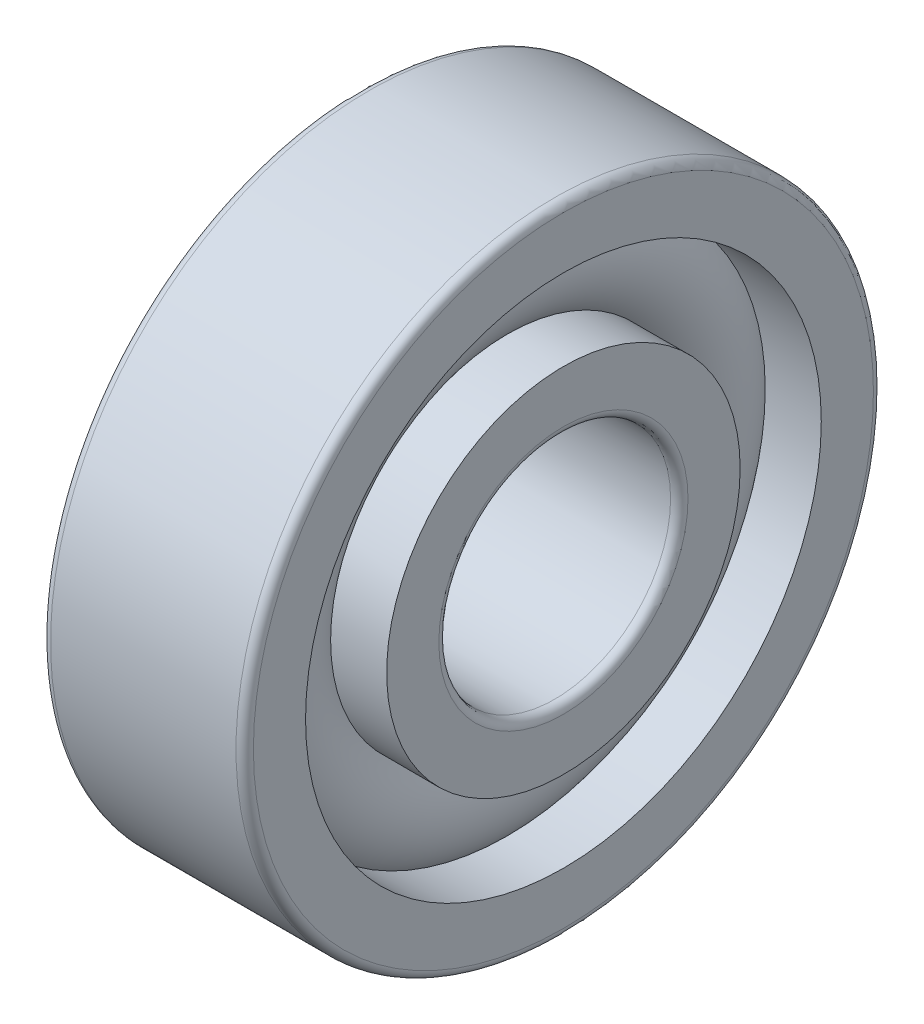
ISO-10303-21;
HEADER;
FILE_DESCRIPTION(('STEP AP214'),'2;1');
FILE_NAME('part.step','',(''),(''),'','','');
FILE_SCHEMA(('AUTOMOTIVE_DESIGN { 1 0 10303 214 1 1 1 1 }'));
ENDSEC;
DATA;
#1=APPLICATION_CONTEXT('core data for automotive mechanical design processes');
#2=APPLICATION_PROTOCOL_DEFINITION('international standard','automotive_design',2000,#1);
#3=PRODUCT_CONTEXT('',#1,'mechanical');
#4=PRODUCT('Part','Part','',(#3));
#5=PRODUCT_RELATED_PRODUCT_CATEGORY('part','',(#4));
#6=PRODUCT_DEFINITION_FORMATION('','',#4);
#7=PRODUCT_DEFINITION_CONTEXT('part definition',#1,'design');
#8=PRODUCT_DEFINITION('design','',#6,#7);
#9=PRODUCT_DEFINITION_SHAPE('','',#8);
#10=(LENGTH_UNIT() NAMED_UNIT(*) SI_UNIT(.MILLI.,.METRE.));
#11=(NAMED_UNIT(*) PLANE_ANGLE_UNIT() SI_UNIT($,.RADIAN.));
#12=(NAMED_UNIT(*) SI_UNIT($,.STERADIAN.) SOLID_ANGLE_UNIT());
#13=UNCERTAINTY_MEASURE_WITH_UNIT(LENGTH_MEASURE(1.E-05),#10,'distance_accuracy_value','');
#14=(GEOMETRIC_REPRESENTATION_CONTEXT(3) GLOBAL_UNCERTAINTY_ASSIGNED_CONTEXT((#13)) GLOBAL_UNIT_ASSIGNED_CONTEXT((#10,
#11,#12)) REPRESENTATION_CONTEXT('',''));
#15=CARTESIAN_POINT('',(0.,0.,0.));
#16=DIRECTION('',(0.,0.,1.));
#17=DIRECTION('',(1.,0.,0.));
#18=AXIS2_PLACEMENT_3D('',#15,#16,#17);
#19=CARTESIAN_POINT('',(0.,0.,0.));
#20=DIRECTION('',(-1.,0.,0.));
#21=DIRECTION('',(0.,0.,1.));
#22=AXIS2_PLACEMENT_3D('',#19,#20,#21);
#23=TOROIDAL_SURFACE('',#22,7.5,2.1);
#24=CARTESIAN_POINT('',(1.56524758424985,0.,0.));
#25=DIRECTION('',(-1.,0.,0.));
#26=DIRECTION('',(0.,0.,1.));
#27=AXIS2_PLACEMENT_3D('',#24,#25,#26);
#28=CIRCLE('',#27,8.90000000000001);
#29=CARTESIAN_POINT('',(1.56524758424985,0.,8.90000000000001));
#30=VERTEX_POINT('',#29);
#31=EDGE_CURVE('E35',#30,#30,#28,.F.);
#32=ORIENTED_EDGE('',*,*,#31,.T.);
#33=EDGE_LOOP('',(#32));
#34=FACE_BOUND('',#33,.T.);
#35=CARTESIAN_POINT('',(1.56524758424985,0.,0.));
#36=DIRECTION('',(-1.,0.,0.));
#37=DIRECTION('',(0.,0.,1.));
#38=AXIS2_PLACEMENT_3D('',#35,#36,#37);
#39=CIRCLE('',#38,6.1);
#40=CARTESIAN_POINT('',(1.56524758424985,0.,6.1));
#41=VERTEX_POINT('',#40);
#42=EDGE_CURVE('E10',#41,#41,#39,.T.);
#43=ORIENTED_EDGE('',*,*,#42,.T.);
#44=EDGE_LOOP('',(#43));
#45=FACE_BOUND('',#44,.T.);
#46=ADVANCED_FACE('F31',(#34,#45),#23,.T.);
#47=CARTESIAN_POINT('',(-20.6375,0.,0.));
#48=DIRECTION('',(1.,0.,0.));
#49=DIRECTION('',(0.,0.,-1.));
#50=AXIS2_PLACEMENT_3D('',#47,#48,#49);
#51=CYLINDRICAL_SURFACE('',#50,6.1);
#52=CARTESIAN_POINT('',(3.5,0.,0.));
#53=DIRECTION('',(1.,0.,0.));
#54=DIRECTION('',(0.,0.,-1.));
#55=AXIS2_PLACEMENT_3D('',#52,#53,#54);
#56=CIRCLE('',#55,6.1);
#57=CARTESIAN_POINT('',(3.5,0.,-6.1));
#58=VERTEX_POINT('',#57);
#59=EDGE_CURVE('E44',#58,#58,#56,.T.);
#60=ORIENTED_EDGE('',*,*,#59,.F.);
#61=EDGE_LOOP('',(#60));
#62=FACE_BOUND('',#61,.T.);
#63=ORIENTED_EDGE('',*,*,#42,.F.);
#64=EDGE_LOOP('',(#63));
#65=FACE_BOUND('',#64,.T.);
#66=ADVANCED_FACE('F83',(#62,#65),#51,.T.);
#67=CARTESIAN_POINT('',(-20.6375,0.,0.));
#68=DIRECTION('',(1.,0.,0.));
#69=DIRECTION('',(0.,0.,-1.));
#70=AXIS2_PLACEMENT_3D('',#67,#68,#69);
#71=CYLINDRICAL_SURFACE('',#70,6.1);
#72=CARTESIAN_POINT('',(-3.5,0.,0.));
#73=DIRECTION('',(1.,0.,0.));
#74=DIRECTION('',(0.,0.,-1.));
#75=AXIS2_PLACEMENT_3D('',#72,#73,#74);
#76=CIRCLE('',#75,6.1);
#77=CARTESIAN_POINT('',(-3.5,0.,-6.1));
#78=VERTEX_POINT('',#77);
#79=EDGE_CURVE('E53',#78,#78,#76,.T.);
#80=ORIENTED_EDGE('',*,*,#79,.T.);
#81=EDGE_LOOP('',(#80));
#82=FACE_BOUND('',#81,.T.);
#83=CARTESIAN_POINT('',(-1.56524758424985,0.,0.));
#84=DIRECTION('',(1.,0.,0.));
#85=DIRECTION('',(0.,0.,-1.));
#86=AXIS2_PLACEMENT_3D('',#83,#84,#85);
#87=CIRCLE('',#86,6.1);
#88=CARTESIAN_POINT('',(-1.56524758424985,0.,-6.1));
#89=VERTEX_POINT('',#88);
#90=EDGE_CURVE('E39',#89,#89,#87,.T.);
#91=ORIENTED_EDGE('',*,*,#90,.F.);
#92=EDGE_LOOP('',(#91));
#93=FACE_BOUND('',#92,.T.);
#94=ADVANCED_FACE('F86',(#82,#93),#71,.T.);
#95=CARTESIAN_POINT('',(3.5,4.3,0.));
#96=DIRECTION('',(1.,0.,0.));
#97=DIRECTION('',(0.,0.,-1.));
#98=AXIS2_PLACEMENT_3D('',#95,#96,#97);
#99=PLANE('',#98);
#100=ORIENTED_EDGE('',*,*,#59,.T.);
#101=EDGE_LOOP('',(#100));
#102=FACE_BOUND('',#101,.T.);
#103=CARTESIAN_POINT('',(3.5,0.,0.));
#104=DIRECTION('',(1.,0.,0.));
#105=DIRECTION('',(0.,0.,-1.));
#106=AXIS2_PLACEMENT_3D('',#103,#104,#105);
#107=CIRCLE('',#106,4.3);
#108=CARTESIAN_POINT('',(3.5,0.,-4.3));
#109=VERTEX_POINT('',#108);
#110=EDGE_CURVE('E75',#109,#109,#107,.T.);
#111=ORIENTED_EDGE('',*,*,#110,.F.);
#112=EDGE_LOOP('',(#111));
#113=FACE_BOUND('',#112,.T.);
#114=ADVANCED_FACE('F80',(#102,#113),#99,.T.);
#115=CARTESIAN_POINT('',(3.2,0.,0.));
#116=DIRECTION('',(1.,0.,0.));
#117=DIRECTION('',(0.,0.,-1.));
#118=AXIS2_PLACEMENT_3D('',#115,#116,#117);
#119=TOROIDAL_SURFACE('',#118,4.3,0.3);
#120=ORIENTED_EDGE('',*,*,#110,.T.);
#121=EDGE_LOOP('',(#120));
#122=FACE_BOUND('',#121,.T.);
#123=CARTESIAN_POINT('',(3.2,0.,0.));
#124=DIRECTION('',(1.,0.,0.));
#125=DIRECTION('',(0.,0.,-1.));
#126=AXIS2_PLACEMENT_3D('',#123,#124,#125);
#127=CIRCLE('',#126,4.);
#128=CARTESIAN_POINT('',(3.2,0.,-4.));
#129=VERTEX_POINT('',#128);
#130=EDGE_CURVE('E72',#129,#129,#127,.T.);
#131=ORIENTED_EDGE('',*,*,#130,.F.);
#132=EDGE_LOOP('',(#131));
#133=FACE_BOUND('',#132,.T.);
#134=ADVANCED_FACE('F97',(#122,#133),#119,.T.);
#135=CARTESIAN_POINT('',(-20.6375,0.,0.));
#136=DIRECTION('',(1.,0.,0.));
#137=DIRECTION('',(0.,0.,-1.));
#138=AXIS2_PLACEMENT_3D('',#135,#136,#137);
#139=CYLINDRICAL_SURFACE('',#138,4.);
#140=ORIENTED_EDGE('',*,*,#130,.T.);
#141=EDGE_LOOP('',(#140));
#142=FACE_BOUND('',#141,.T.);
#143=CARTESIAN_POINT('',(-3.2,0.,0.));
#144=DIRECTION('',(1.,0.,0.));
#145=DIRECTION('',(0.,0.,-1.));
#146=AXIS2_PLACEMENT_3D('',#143,#144,#145);
#147=CIRCLE('',#146,4.);
#148=CARTESIAN_POINT('',(-3.2,0.,-4.));
#149=VERTEX_POINT('',#148);
#150=EDGE_CURVE('E69',#149,#149,#147,.T.);
#151=ORIENTED_EDGE('',*,*,#150,.F.);
#152=EDGE_LOOP('',(#151));
#153=FACE_BOUND('',#152,.T.);
#154=ADVANCED_FACE('F100',(#142,#153),#139,.F.);
#155=CARTESIAN_POINT('',(-3.2,0.,0.));
#156=DIRECTION('',(1.,0.,0.));
#157=DIRECTION('',(0.,0.,-1.));
#158=AXIS2_PLACEMENT_3D('',#155,#156,#157);
#159=TOROIDAL_SURFACE('',#158,4.3,0.3);
#160=ORIENTED_EDGE('',*,*,#150,.T.);
#161=EDGE_LOOP('',(#160));
#162=FACE_BOUND('',#161,.T.);
#163=CARTESIAN_POINT('',(-3.5,0.,0.));
#164=DIRECTION('',(1.,0.,0.));
#165=DIRECTION('',(0.,0.,-1.));
#166=AXIS2_PLACEMENT_3D('',#163,#164,#165);
#167=CIRCLE('',#166,4.3);
#168=CARTESIAN_POINT('',(-3.5,0.,-4.3));
#169=VERTEX_POINT('',#168);
#170=EDGE_CURVE('E66',#169,#169,#167,.T.);
#171=ORIENTED_EDGE('',*,*,#170,.F.);
#172=EDGE_LOOP('',(#171));
#173=FACE_BOUND('',#172,.T.);
#174=ADVANCED_FACE('F104',(#162,#173),#159,.T.);
#175=CARTESIAN_POINT('',(-3.5,6.1,0.));
#176=DIRECTION('',(-1.,0.,0.));
#177=DIRECTION('',(0.,0.,1.));
#178=AXIS2_PLACEMENT_3D('',#175,#176,#177);
#179=PLANE('',#178);
#180=ORIENTED_EDGE('',*,*,#170,.T.);
#181=EDGE_LOOP('',(#180));
#182=FACE_BOUND('',#181,.T.);
#183=ORIENTED_EDGE('',*,*,#79,.F.);
#184=EDGE_LOOP('',(#183));
#185=FACE_BOUND('',#184,.T.);
#186=ADVANCED_FACE('F108',(#182,#185),#179,.T.);
#187=CARTESIAN_POINT('',(-1.56524758424985,0.,0.));
#188=DIRECTION('',(1.,0.,0.));
#189=DIRECTION('',(0.,0.,-1.));
#190=AXIS2_PLACEMENT_3D('',#187,#188,#189);
#191=CIRCLE('',#190,8.90000000000001);
#192=CARTESIAN_POINT('',(-1.56524758424985,0.,-8.90000000000001));
#193=VERTEX_POINT('',#192);
#194=EDGE_CURVE('E47',#193,#193,#191,.F.);
#195=ORIENTED_EDGE('',*,*,#194,.T.);
#196=EDGE_LOOP('',(#195));
#197=FACE_BOUND('',#196,.T.);
#198=ORIENTED_EDGE('',*,*,#90,.T.);
#199=EDGE_LOOP('',(#198));
#200=FACE_BOUND('',#199,.T.);
#201=ADVANCED_FACE('F33',(#197,#200),#23,.T.);
#202=CARTESIAN_POINT('',(-20.6375,0.,0.));
#203=DIRECTION('',(1.,0.,0.));
#204=DIRECTION('',(0.,0.,-1.));
#205=AXIS2_PLACEMENT_3D('',#202,#203,#204);
#206=CYLINDRICAL_SURFACE('',#205,8.90000000000001);
#207=CARTESIAN_POINT('',(3.5,0.,0.));
#208=DIRECTION('',(1.,0.,0.));
#209=DIRECTION('',(0.,0.,-1.));
#210=AXIS2_PLACEMENT_3D('',#207,#208,#209);
#211=CIRCLE('',#210,8.90000000000001);
#212=CARTESIAN_POINT('',(3.5,0.,-8.90000000000001));
#213=VERTEX_POINT('',#212);
#214=EDGE_CURVE('E49',#213,#213,#211,.T.);
#215=ORIENTED_EDGE('',*,*,#214,.T.);
#216=EDGE_LOOP('',(#215));
#217=FACE_BOUND('',#216,.T.);
#218=ORIENTED_EDGE('',*,*,#31,.F.);
#219=EDGE_LOOP('',(#218));
#220=FACE_BOUND('',#219,.T.);
#221=ADVANCED_FACE('F113',(#217,#220),#206,.F.);
#222=CARTESIAN_POINT('',(-20.6375,0.,0.));
#223=DIRECTION('',(1.,0.,0.));
#224=DIRECTION('',(0.,0.,-1.));
#225=AXIS2_PLACEMENT_3D('',#222,#223,#224);
#226=CYLINDRICAL_SURFACE('',#225,8.90000000000001);
#227=CARTESIAN_POINT('',(-3.5,0.,0.));
#228=DIRECTION('',(1.,0.,0.));
#229=DIRECTION('',(0.,0.,-1.));
#230=AXIS2_PLACEMENT_3D('',#227,#228,#229);
#231=CIRCLE('',#230,8.90000000000001);
#232=CARTESIAN_POINT('',(-3.5,0.,-8.90000000000001));
#233=VERTEX_POINT('',#232);
#234=EDGE_CURVE('E144',#233,#233,#231,.T.);
#235=ORIENTED_EDGE('',*,*,#234,.F.);
#236=EDGE_LOOP('',(#235));
#237=FACE_BOUND('',#236,.T.);
#238=ORIENTED_EDGE('',*,*,#194,.F.);
#239=EDGE_LOOP('',(#238));
#240=FACE_BOUND('',#239,.T.);
#241=ADVANCED_FACE('F116',(#237,#240),#226,.F.);
#242=CARTESIAN_POINT('',(3.5,10.7,0.));
#243=DIRECTION('',(1.,0.,0.));
#244=DIRECTION('',(0.,0.,-1.));
#245=AXIS2_PLACEMENT_3D('',#242,#243,#244);
#246=PLANE('',#245);
#247=CARTESIAN_POINT('',(3.5,0.,0.));
#248=DIRECTION('',(1.,0.,0.));
#249=DIRECTION('',(0.,0.,-1.));
#250=AXIS2_PLACEMENT_3D('',#247,#248,#249);
#251=CIRCLE('',#250,10.7);
#252=CARTESIAN_POINT('',(3.5,0.,-10.7));
#253=VERTEX_POINT('',#252);
#254=EDGE_CURVE('E55',#253,#253,#251,.T.);
#255=ORIENTED_EDGE('',*,*,#254,.T.);
#256=EDGE_LOOP('',(#255));
#257=FACE_BOUND('',#256,.T.);
#258=ORIENTED_EDGE('',*,*,#214,.F.);
#259=EDGE_LOOP('',(#258));
#260=FACE_BOUND('',#259,.T.);
#261=ADVANCED_FACE('F117',(#257,#260),#246,.T.);
#262=CARTESIAN_POINT('',(3.2,0.,0.));
#263=DIRECTION('',(1.,0.,0.));
#264=DIRECTION('',(0.,0.,-1.));
#265=AXIS2_PLACEMENT_3D('',#262,#263,#264);
#266=TOROIDAL_SURFACE('',#265,10.7,0.299999999999999);
#267=CARTESIAN_POINT('',(3.2,0.,0.));
#268=DIRECTION('',(1.,0.,0.));
#269=DIRECTION('',(0.,0.,-1.));
#270=AXIS2_PLACEMENT_3D('',#267,#268,#269);
#271=CIRCLE('',#270,11.);
#272=CARTESIAN_POINT('',(3.2,0.,-11.));
#273=VERTEX_POINT('',#272);
#274=EDGE_CURVE('E60',#273,#273,#271,.T.);
#275=ORIENTED_EDGE('',*,*,#274,.T.);
#276=EDGE_LOOP('',(#275));
#277=FACE_BOUND('',#276,.T.);
#278=ORIENTED_EDGE('',*,*,#254,.F.);
#279=EDGE_LOOP('',(#278));
#280=FACE_BOUND('',#279,.T.);
#281=ADVANCED_FACE('F120',(#277,#280),#266,.T.);
#282=CARTESIAN_POINT('',(-20.6375,0.,0.));
#283=DIRECTION('',(1.,0.,0.));
#284=DIRECTION('',(0.,0.,-1.));
#285=AXIS2_PLACEMENT_3D('',#282,#283,#284);
#286=CYLINDRICAL_SURFACE('',#285,11.);
#287=CARTESIAN_POINT('',(-3.2,0.,0.));
#288=DIRECTION('',(1.,0.,0.));
#289=DIRECTION('',(0.,0.,-1.));
#290=AXIS2_PLACEMENT_3D('',#287,#288,#289);
#291=CIRCLE('',#290,11.);
#292=CARTESIAN_POINT('',(-3.2,0.,-11.));
#293=VERTEX_POINT('',#292);
#294=EDGE_CURVE('E148',#293,#293,#291,.T.);
#295=ORIENTED_EDGE('',*,*,#294,.T.);
#296=EDGE_LOOP('',(#295));
#297=FACE_BOUND('',#296,.T.);
#298=ORIENTED_EDGE('',*,*,#274,.F.);
#299=EDGE_LOOP('',(#298));
#300=FACE_BOUND('',#299,.T.);
#301=ADVANCED_FACE('F124',(#297,#300),#286,.T.);
#302=CARTESIAN_POINT('',(-3.2,0.,0.));
#303=DIRECTION('',(1.,0.,0.));
#304=DIRECTION('',(0.,0.,-1.));
#305=AXIS2_PLACEMENT_3D('',#302,#303,#304);
#306=TOROIDAL_SURFACE('',#305,10.7,0.299999999999999);
#307=CARTESIAN_POINT('',(-3.5,0.,0.));
#308=DIRECTION('',(1.,0.,0.));
#309=DIRECTION('',(0.,0.,-1.));
#310=AXIS2_PLACEMENT_3D('',#307,#308,#309);
#311=CIRCLE('',#310,10.7);
#312=CARTESIAN_POINT('',(-3.5,0.,-10.7));
#313=VERTEX_POINT('',#312);
#314=EDGE_CURVE('E145',#313,#313,#311,.T.);
#315=ORIENTED_EDGE('',*,*,#314,.T.);
#316=EDGE_LOOP('',(#315));
#317=FACE_BOUND('',#316,.T.);
#318=ORIENTED_EDGE('',*,*,#294,.F.);
#319=EDGE_LOOP('',(#318));
#320=FACE_BOUND('',#319,.T.);
#321=ADVANCED_FACE('F128',(#317,#320),#306,.T.);
#322=CARTESIAN_POINT('',(-3.5,8.90000000000001,0.));
#323=DIRECTION('',(-1.,0.,0.));
#324=DIRECTION('',(0.,0.,1.));
#325=AXIS2_PLACEMENT_3D('',#322,#323,#324);
#326=PLANE('',#325);
#327=ORIENTED_EDGE('',*,*,#234,.T.);
#328=EDGE_LOOP('',(#327));
#329=FACE_BOUND('',#328,.T.);
#330=ORIENTED_EDGE('',*,*,#314,.F.);
#331=EDGE_LOOP('',(#330));
#332=FACE_BOUND('',#331,.T.);
#333=ADVANCED_FACE('F132',(#329,#332),#326,.T.);
#334=CLOSED_SHELL('',(#46,#66,#94,#114,#134,#154,#174,#186,#201,#221,#241,#261,#281,#301,#321,#333));
#335=MANIFOLD_SOLID_BREP('B2',#334);
#336=ADVANCED_BREP_SHAPE_REPRESENTATION('',(#18,#335),#14);
#337=SHAPE_DEFINITION_REPRESENTATION(#9,#336);
ENDSEC;
END-ISO-10303-21;
